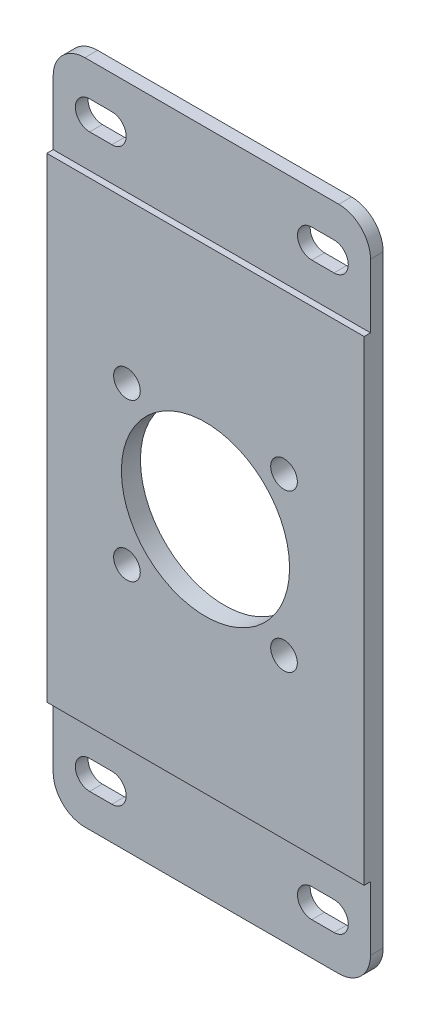
ISO-10303-21;
HEADER;
FILE_DESCRIPTION(('STEP AP214'),'2;1');
FILE_NAME('part.step','',(''),(''),'','','');
FILE_SCHEMA(('AUTOMOTIVE_DESIGN { 1 0 10303 214 1 1 1 1 }'));
ENDSEC;
DATA;
#1=APPLICATION_CONTEXT('core data for automotive mechanical design processes');
#2=APPLICATION_PROTOCOL_DEFINITION('international standard','automotive_design',2000,#1);
#3=PRODUCT_CONTEXT('',#1,'mechanical');
#4=PRODUCT('Part','Part','',(#3));
#5=PRODUCT_RELATED_PRODUCT_CATEGORY('part','',(#4));
#6=PRODUCT_DEFINITION_FORMATION('','',#4);
#7=PRODUCT_DEFINITION_CONTEXT('part definition',#1,'design');
#8=PRODUCT_DEFINITION('design','',#6,#7);
#9=PRODUCT_DEFINITION_SHAPE('','',#8);
#10=(LENGTH_UNIT() NAMED_UNIT(*) SI_UNIT(.MILLI.,.METRE.));
#11=(NAMED_UNIT(*) PLANE_ANGLE_UNIT() SI_UNIT($,.RADIAN.));
#12=(NAMED_UNIT(*) SI_UNIT($,.STERADIAN.) SOLID_ANGLE_UNIT());
#13=UNCERTAINTY_MEASURE_WITH_UNIT(LENGTH_MEASURE(1.E-05),#10,'distance_accuracy_value','');
#14=(GEOMETRIC_REPRESENTATION_CONTEXT(3) GLOBAL_UNCERTAINTY_ASSIGNED_CONTEXT((#13)) GLOBAL_UNIT_ASSIGNED_CONTEXT((#10,
#11,#12)) REPRESENTATION_CONTEXT('',''));
#15=CARTESIAN_POINT('',(0.,0.,0.));
#16=DIRECTION('',(0.,0.,1.));
#17=DIRECTION('',(1.,0.,0.));
#18=AXIS2_PLACEMENT_3D('',#15,#16,#17);
#19=CARTESIAN_POINT('',(0.,105.,3.));
#20=DIRECTION('',(0.,-1.,0.));
#21=DIRECTION('',(0.,0.,-1.));
#22=AXIS2_PLACEMENT_3D('',#19,#20,#21);
#23=PLANE('',#22);
#24=DIRECTION('',(-1.,0.,0.));
#25=VECTOR('',#24,1.);
#26=CARTESIAN_POINT('',(0.,105.,0.));
#27=LINE('',#26,#25);
#28=CARTESIAN_POINT('',(45.,105.,0.));
#29=VERTEX_POINT('',#28);
#30=CARTESIAN_POINT('',(5.,105.,0.));
#31=VERTEX_POINT('',#30);
#32=EDGE_CURVE('E424',#29,#31,#27,.T.);
#33=ORIENTED_EDGE('',*,*,#32,.T.);
#34=DIRECTION('',(0.,0.,-1.));
#35=VECTOR('',#34,1.);
#36=CARTESIAN_POINT('',(5.,105.,3.));
#37=LINE('',#36,#35);
#38=CARTESIAN_POINT('',(5.,105.,2.));
#39=VERTEX_POINT('',#38);
#40=EDGE_CURVE('E58',#31,#39,#37,.F.);
#41=ORIENTED_EDGE('',*,*,#40,.T.);
#42=DIRECTION('',(-1.,0.,0.));
#43=VECTOR('',#42,1.);
#44=CARTESIAN_POINT('',(0.,105.,2.));
#45=LINE('',#44,#43);
#46=CARTESIAN_POINT('',(45.,105.,2.));
#47=VERTEX_POINT('',#46);
#48=EDGE_CURVE('E253',#47,#39,#45,.T.);
#49=ORIENTED_EDGE('',*,*,#48,.F.);
#50=DIRECTION('',(0.,0.,-1.));
#51=VECTOR('',#50,1.);
#52=CARTESIAN_POINT('',(45.,105.,3.));
#53=LINE('',#52,#51);
#54=EDGE_CURVE('E466',#47,#29,#53,.T.);
#55=ORIENTED_EDGE('',*,*,#54,.T.);
#56=EDGE_LOOP('',(#33,#41,#49,#55));
#57=FACE_BOUND('',#56,.T.);
#58=ADVANCED_FACE('F43',(#57),#23,.F.);
#59=CARTESIAN_POINT('',(40.7500001007836,97.5,3.));
#60=DIRECTION('',(0.,0.,-1.));
#61=DIRECTION('',(-1.,0.,0.));
#62=AXIS2_PLACEMENT_3D('',#59,#60,#61);
#63=CYLINDRICAL_SURFACE('',#62,2.25);
#64=DIRECTION('',(0.,0.,-1.));
#65=VECTOR('',#64,1.);
#66=CARTESIAN_POINT('',(40.7500001007836,99.75,3.));
#67=LINE('',#66,#65);
#68=CARTESIAN_POINT('',(40.7500001007836,99.75,2.));
#69=VERTEX_POINT('',#68);
#70=CARTESIAN_POINT('',(40.7500001007836,99.75,0.));
#71=VERTEX_POINT('',#70);
#72=EDGE_CURVE('E343',#69,#71,#67,.T.);
#73=ORIENTED_EDGE('',*,*,#72,.F.);
#74=CARTESIAN_POINT('',(40.7500001007836,97.5,2.));
#75=DIRECTION('',(0.,0.,1.));
#76=DIRECTION('',(1.,0.,0.));
#77=AXIS2_PLACEMENT_3D('',#74,#75,#76);
#78=CIRCLE('',#77,2.25);
#79=CARTESIAN_POINT('',(40.7500001007836,95.25,2.));
#80=VERTEX_POINT('',#79);
#81=EDGE_CURVE('E294',#69,#80,#78,.T.);
#82=ORIENTED_EDGE('',*,*,#81,.T.);
#83=DIRECTION('',(0.,0.,-1.));
#84=VECTOR('',#83,1.);
#85=CARTESIAN_POINT('',(40.7500001007836,95.25,3.));
#86=LINE('',#85,#84);
#87=CARTESIAN_POINT('',(40.7500001007836,95.25,0.));
#88=VERTEX_POINT('',#87);
#89=EDGE_CURVE('E349',#80,#88,#86,.T.);
#90=ORIENTED_EDGE('',*,*,#89,.T.);
#91=CARTESIAN_POINT('',(40.7500001007836,97.5,0.));
#92=DIRECTION('',(0.,0.,1.));
#93=DIRECTION('',(1.,0.,0.));
#94=AXIS2_PLACEMENT_3D('',#91,#92,#93);
#95=CIRCLE('',#94,2.25);
#96=EDGE_CURVE('E331',#71,#88,#95,.T.);
#97=ORIENTED_EDGE('',*,*,#96,.F.);
#98=EDGE_LOOP('',(#73,#82,#90,#97));
#99=FACE_BOUND('',#98,.T.);
#100=ADVANCED_FACE('F515',(#99),#63,.F.);
#101=CARTESIAN_POINT('',(40.7500001007836,95.25,3.));
#102=DIRECTION('',(0.,1.,0.));
#103=DIRECTION('',(0.,0.,1.));
#104=AXIS2_PLACEMENT_3D('',#101,#102,#103);
#105=PLANE('',#104);
#106=ORIENTED_EDGE('',*,*,#89,.F.);
#107=DIRECTION('',(1.,0.,0.));
#108=VECTOR('',#107,1.);
#109=CARTESIAN_POINT('',(40.7500001007836,95.25,2.));
#110=LINE('',#109,#108);
#111=CARTESIAN_POINT('',(44.2500001007836,95.25,2.));
#112=VERTEX_POINT('',#111);
#113=EDGE_CURVE('E291',#80,#112,#110,.T.);
#114=ORIENTED_EDGE('',*,*,#113,.T.);
#115=DIRECTION('',(0.,0.,-1.));
#116=VECTOR('',#115,1.);
#117=CARTESIAN_POINT('',(44.2500001007836,95.25,3.));
#118=LINE('',#117,#116);
#119=CARTESIAN_POINT('',(44.2500001007836,95.25,0.));
#120=VERTEX_POINT('',#119);
#121=EDGE_CURVE('E347',#112,#120,#118,.T.);
#122=ORIENTED_EDGE('',*,*,#121,.T.);
#123=DIRECTION('',(1.,0.,0.));
#124=VECTOR('',#123,1.);
#125=CARTESIAN_POINT('',(40.7500001007836,95.25,0.));
#126=LINE('',#125,#124);
#127=EDGE_CURVE('E334',#88,#120,#126,.T.);
#128=ORIENTED_EDGE('',*,*,#127,.F.);
#129=EDGE_LOOP('',(#106,#114,#122,#128));
#130=FACE_BOUND('',#129,.T.);
#131=ADVANCED_FACE('F522',(#130),#105,.T.);
#132=CARTESIAN_POINT('',(44.2500001007836,97.5,3.));
#133=DIRECTION('',(0.,0.,-1.));
#134=DIRECTION('',(-1.,0.,0.));
#135=AXIS2_PLACEMENT_3D('',#132,#133,#134);
#136=CYLINDRICAL_SURFACE('',#135,2.25);
#137=ORIENTED_EDGE('',*,*,#121,.F.);
#138=CARTESIAN_POINT('',(44.2500001007836,97.5,2.));
#139=DIRECTION('',(0.,0.,1.));
#140=DIRECTION('',(1.,0.,0.));
#141=AXIS2_PLACEMENT_3D('',#138,#139,#140);
#142=CIRCLE('',#141,2.25);
#143=CARTESIAN_POINT('',(44.2500001007836,99.75,2.));
#144=VERTEX_POINT('',#143);
#145=EDGE_CURVE('E288',#112,#144,#142,.T.);
#146=ORIENTED_EDGE('',*,*,#145,.T.);
#147=DIRECTION('',(0.,0.,-1.));
#148=VECTOR('',#147,1.);
#149=CARTESIAN_POINT('',(44.2500001007836,99.75,3.));
#150=LINE('',#149,#148);
#151=CARTESIAN_POINT('',(44.2500001007836,99.75,0.));
#152=VERTEX_POINT('',#151);
#153=EDGE_CURVE('E345',#144,#152,#150,.T.);
#154=ORIENTED_EDGE('',*,*,#153,.T.);
#155=CARTESIAN_POINT('',(44.2500001007836,97.5,0.));
#156=DIRECTION('',(0.,0.,1.));
#157=DIRECTION('',(1.,0.,0.));
#158=AXIS2_PLACEMENT_3D('',#155,#156,#157);
#159=CIRCLE('',#158,2.25);
#160=EDGE_CURVE('E337',#120,#152,#159,.T.);
#161=ORIENTED_EDGE('',*,*,#160,.F.);
#162=EDGE_LOOP('',(#137,#146,#154,#161));
#163=FACE_BOUND('',#162,.T.);
#164=ADVANCED_FACE('F606',(#163),#136,.F.);
#165=CARTESIAN_POINT('',(40.7500001007836,99.75,3.));
#166=DIRECTION('',(0.,-1.,0.));
#167=DIRECTION('',(0.,0.,-1.));
#168=AXIS2_PLACEMENT_3D('',#165,#166,#167);
#169=PLANE('',#168);
#170=ORIENTED_EDGE('',*,*,#153,.F.);
#171=DIRECTION('',(-1.,0.,0.));
#172=VECTOR('',#171,1.);
#173=CARTESIAN_POINT('',(40.7500001007836,99.75,2.));
#174=LINE('',#173,#172);
#175=EDGE_CURVE('E285',#144,#69,#174,.T.);
#176=ORIENTED_EDGE('',*,*,#175,.T.);
#177=ORIENTED_EDGE('',*,*,#72,.T.);
#178=DIRECTION('',(-1.,0.,0.));
#179=VECTOR('',#178,1.);
#180=CARTESIAN_POINT('',(40.7500001007836,99.75,0.));
#181=LINE('',#180,#179);
#182=EDGE_CURVE('E340',#152,#71,#181,.T.);
#183=ORIENTED_EDGE('',*,*,#182,.F.);
#184=EDGE_LOOP('',(#170,#176,#177,#183));
#185=FACE_BOUND('',#184,.T.);
#186=ADVANCED_FACE('F616',(#185),#169,.T.);
#187=CARTESIAN_POINT('',(5.7499998992164,97.4999999999998,3.));
#188=DIRECTION('',(0.,0.,-1.));
#189=DIRECTION('',(-1.,0.,0.));
#190=AXIS2_PLACEMENT_3D('',#187,#188,#189);
#191=CYLINDRICAL_SURFACE('',#190,2.25000000000002);
#192=DIRECTION('',(0.,0.,-1.));
#193=VECTOR('',#192,1.);
#194=CARTESIAN_POINT('',(5.7499998992164,99.75,3.));
#195=LINE('',#194,#193);
#196=CARTESIAN_POINT('',(5.7499998992164,99.75,2.));
#197=VERTEX_POINT('',#196);
#198=CARTESIAN_POINT('',(5.7499998992164,99.75,0.));
#199=VERTEX_POINT('',#198);
#200=EDGE_CURVE('E323',#197,#199,#195,.T.);
#201=ORIENTED_EDGE('',*,*,#200,.F.);
#202=CARTESIAN_POINT('',(5.7499998992164,97.4999999999998,2.));
#203=DIRECTION('',(0.,0.,1.));
#204=DIRECTION('',(1.,0.,0.));
#205=AXIS2_PLACEMENT_3D('',#202,#203,#204);
#206=CIRCLE('',#205,2.25000000000002);
#207=CARTESIAN_POINT('',(5.7499998992164,95.25,2.));
#208=VERTEX_POINT('',#207);
#209=EDGE_CURVE('E282',#197,#208,#206,.T.);
#210=ORIENTED_EDGE('',*,*,#209,.T.);
#211=DIRECTION('',(0.,0.,-1.));
#212=VECTOR('',#211,1.);
#213=CARTESIAN_POINT('',(5.7499998992164,95.25,3.));
#214=LINE('',#213,#212);
#215=CARTESIAN_POINT('',(5.7499998992164,95.25,0.));
#216=VERTEX_POINT('',#215);
#217=EDGE_CURVE('E329',#208,#216,#214,.T.);
#218=ORIENTED_EDGE('',*,*,#217,.T.);
#219=CARTESIAN_POINT('',(5.7499998992164,97.4999999999998,0.));
#220=DIRECTION('',(0.,0.,1.));
#221=DIRECTION('',(1.,0.,0.));
#222=AXIS2_PLACEMENT_3D('',#219,#220,#221);
#223=CIRCLE('',#222,2.25000000000002);
#224=EDGE_CURVE('E311',#199,#216,#223,.T.);
#225=ORIENTED_EDGE('',*,*,#224,.F.);
#226=EDGE_LOOP('',(#201,#210,#218,#225));
#227=FACE_BOUND('',#226,.T.);
#228=ADVANCED_FACE('F626',(#227),#191,.F.);
#229=CARTESIAN_POINT('',(5.7499998992164,95.25,3.));
#230=DIRECTION('',(0.,1.,0.));
#231=DIRECTION('',(0.,0.,1.));
#232=AXIS2_PLACEMENT_3D('',#229,#230,#231);
#233=PLANE('',#232);
#234=ORIENTED_EDGE('',*,*,#217,.F.);
#235=DIRECTION('',(1.,0.,0.));
#236=VECTOR('',#235,1.);
#237=CARTESIAN_POINT('',(5.7499998992164,95.25,2.));
#238=LINE('',#237,#236);
#239=CARTESIAN_POINT('',(9.2499998992164,95.2499999999998,2.));
#240=VERTEX_POINT('',#239);
#241=EDGE_CURVE('E279',#208,#240,#238,.T.);
#242=ORIENTED_EDGE('',*,*,#241,.T.);
#243=DIRECTION('',(0.,0.,-1.));
#244=VECTOR('',#243,1.);
#245=CARTESIAN_POINT('',(9.2499998992164,95.2499999999998,3.));
#246=LINE('',#245,#244);
#247=CARTESIAN_POINT('',(9.2499998992164,95.2499999999998,0.));
#248=VERTEX_POINT('',#247);
#249=EDGE_CURVE('E327',#240,#248,#246,.T.);
#250=ORIENTED_EDGE('',*,*,#249,.T.);
#251=DIRECTION('',(1.,0.,0.));
#252=VECTOR('',#251,1.);
#253=CARTESIAN_POINT('',(5.7499998992164,95.25,0.));
#254=LINE('',#253,#252);
#255=EDGE_CURVE('E314',#216,#248,#254,.T.);
#256=ORIENTED_EDGE('',*,*,#255,.F.);
#257=EDGE_LOOP('',(#234,#242,#250,#256));
#258=FACE_BOUND('',#257,.T.);
#259=ADVANCED_FACE('F636',(#258),#233,.T.);
#260=CARTESIAN_POINT('',(9.2499998992164,97.4999999999998,3.));
#261=DIRECTION('',(0.,0.,-1.));
#262=DIRECTION('',(-1.,0.,0.));
#263=AXIS2_PLACEMENT_3D('',#260,#261,#262);
#264=CYLINDRICAL_SURFACE('',#263,2.25000000000002);
#265=ORIENTED_EDGE('',*,*,#249,.F.);
#266=CARTESIAN_POINT('',(9.2499998992164,97.4999999999998,2.));
#267=DIRECTION('',(0.,0.,1.));
#268=DIRECTION('',(1.,0.,0.));
#269=AXIS2_PLACEMENT_3D('',#266,#267,#268);
#270=CIRCLE('',#269,2.25000000000002);
#271=CARTESIAN_POINT('',(9.2499998992164,99.75,2.));
#272=VERTEX_POINT('',#271);
#273=EDGE_CURVE('E255',#240,#272,#270,.T.);
#274=ORIENTED_EDGE('',*,*,#273,.T.);
#275=DIRECTION('',(0.,0.,-1.));
#276=VECTOR('',#275,1.);
#277=CARTESIAN_POINT('',(9.2499998992164,99.75,3.));
#278=LINE('',#277,#276);
#279=CARTESIAN_POINT('',(9.2499998992164,99.75,0.));
#280=VERTEX_POINT('',#279);
#281=EDGE_CURVE('E325',#272,#280,#278,.T.);
#282=ORIENTED_EDGE('',*,*,#281,.T.);
#283=CARTESIAN_POINT('',(9.2499998992164,97.4999999999998,0.));
#284=DIRECTION('',(0.,0.,1.));
#285=DIRECTION('',(1.,0.,0.));
#286=AXIS2_PLACEMENT_3D('',#283,#284,#285);
#287=CIRCLE('',#286,2.25000000000002);
#288=EDGE_CURVE('E317',#248,#280,#287,.T.);
#289=ORIENTED_EDGE('',*,*,#288,.F.);
#290=EDGE_LOOP('',(#265,#274,#282,#289));
#291=FACE_BOUND('',#290,.T.);
#292=ADVANCED_FACE('F646',(#291),#264,.F.);
#293=CARTESIAN_POINT('',(5.7499998992164,99.75,3.));
#294=DIRECTION('',(0.,-1.,0.));
#295=DIRECTION('',(0.,0.,-1.));
#296=AXIS2_PLACEMENT_3D('',#293,#294,#295);
#297=PLANE('',#296);
#298=ORIENTED_EDGE('',*,*,#281,.F.);
#299=DIRECTION('',(-1.,0.,0.));
#300=VECTOR('',#299,1.);
#301=CARTESIAN_POINT('',(5.7499998992164,99.75,2.));
#302=LINE('',#301,#300);
#303=EDGE_CURVE('E427',#272,#197,#302,.T.);
#304=ORIENTED_EDGE('',*,*,#303,.T.);
#305=ORIENTED_EDGE('',*,*,#200,.T.);
#306=DIRECTION('',(-1.,0.,0.));
#307=VECTOR('',#306,1.);
#308=CARTESIAN_POINT('',(5.7499998992164,99.75,0.));
#309=LINE('',#308,#307);
#310=EDGE_CURVE('E320',#280,#199,#309,.T.);
#311=ORIENTED_EDGE('',*,*,#310,.F.);
#312=EDGE_LOOP('',(#298,#304,#305,#311));
#313=FACE_BOUND('',#312,.T.);
#314=ADVANCED_FACE('F656',(#313),#297,.T.);
#315=CARTESIAN_POINT('',(0.,0.,3.));
#316=DIRECTION('',(0.,0.,-1.));
#317=DIRECTION('',(-1.,0.,0.));
#318=AXIS2_PLACEMENT_3D('',#315,#316,#317);
#319=PLANE('',#318);
#320=DIRECTION('',(0.,1.,0.));
#321=VECTOR('',#320,1.);
#322=CARTESIAN_POINT('',(50.,0.,3.));
#323=LINE('',#322,#321);
#324=CARTESIAN_POINT('',(50.,15.05,3.));
#325=VERTEX_POINT('',#324);
#326=CARTESIAN_POINT('',(50.,89.95,3.));
#327=VERTEX_POINT('',#326);
#328=EDGE_CURVE('E423',#325,#327,#323,.T.);
#329=ORIENTED_EDGE('',*,*,#328,.T.);
#330=DIRECTION('',(1.,0.,0.));
#331=VECTOR('',#330,1.);
#332=CARTESIAN_POINT('',(0.,89.95,3.));
#333=LINE('',#332,#331);
#334=CARTESIAN_POINT('',(0.,89.95,3.));
#335=VERTEX_POINT('',#334);
#336=EDGE_CURVE('E237',#335,#327,#333,.T.);
#337=ORIENTED_EDGE('',*,*,#336,.F.);
#338=DIRECTION('',(0.,-1.,0.));
#339=VECTOR('',#338,1.);
#340=CARTESIAN_POINT('',(0.,0.,3.));
#341=LINE('',#340,#339);
#342=CARTESIAN_POINT('',(0.,15.05,3.));
#343=VERTEX_POINT('',#342);
#344=EDGE_CURVE('E252',#335,#343,#341,.T.);
#345=ORIENTED_EDGE('',*,*,#344,.T.);
#346=DIRECTION('',(-1.,0.,0.));
#347=VECTOR('',#346,1.);
#348=CARTESIAN_POINT('',(0.,15.05,3.));
#349=LINE('',#348,#347);
#350=EDGE_CURVE('E265',#325,#343,#349,.T.);
#351=ORIENTED_EDGE('',*,*,#350,.F.);
#352=EDGE_LOOP('',(#329,#337,#345,#351));
#353=FACE_BOUND('',#352,.T.);
#354=CARTESIAN_POINT('',(25.,52.5,3.));
#355=DIRECTION('',(0.,0.,1.));
#356=DIRECTION('',(1.,0.,0.));
#357=AXIS2_PLACEMENT_3D('',#354,#355,#356);
#358=CIRCLE('',#357,13.25);
#359=CARTESIAN_POINT('',(38.25,52.5,3.));
#360=VERTEX_POINT('',#359);
#361=EDGE_CURVE('E416',#360,#360,#358,.T.);
#362=ORIENTED_EDGE('',*,*,#361,.F.);
#363=EDGE_LOOP('',(#362));
#364=FACE_BOUND('',#363,.T.);
#365=CARTESIAN_POINT('',(37.3743686707645,64.8743686707647,3.));
#366=DIRECTION('',(0.,0.,1.));
#367=DIRECTION('',(1.,0.,0.));
#368=AXIS2_PLACEMENT_3D('',#365,#366,#367);
#369=CIRCLE('',#368,2.1);
#370=CARTESIAN_POINT('',(39.4743686707645,64.8743686707647,3.));
#371=VERTEX_POINT('',#370);
#372=EDGE_CURVE('E410',#371,#371,#369,.T.);
#373=ORIENTED_EDGE('',*,*,#372,.F.);
#374=EDGE_LOOP('',(#373));
#375=FACE_BOUND('',#374,.T.);
#376=CARTESIAN_POINT('',(12.6256313292353,64.8743686707645,3.));
#377=DIRECTION('',(0.,0.,1.));
#378=DIRECTION('',(1.,0.,0.));
#379=AXIS2_PLACEMENT_3D('',#376,#377,#378);
#380=CIRCLE('',#379,2.1);
#381=CARTESIAN_POINT('',(14.7256313292353,64.8743686707645,3.));
#382=VERTEX_POINT('',#381);
#383=EDGE_CURVE('E404',#382,#382,#380,.T.);
#384=ORIENTED_EDGE('',*,*,#383,.F.);
#385=EDGE_LOOP('',(#384));
#386=FACE_BOUND('',#385,.T.);
#387=CARTESIAN_POINT('',(37.3743686707646,40.1256313292355,3.));
#388=DIRECTION('',(0.,0.,1.));
#389=DIRECTION('',(1.,0.,0.));
#390=AXIS2_PLACEMENT_3D('',#387,#388,#389);
#391=CIRCLE('',#390,2.1);
#392=CARTESIAN_POINT('',(39.4743686707646,40.1256313292355,3.));
#393=VERTEX_POINT('',#392);
#394=EDGE_CURVE('E398',#393,#393,#391,.T.);
#395=ORIENTED_EDGE('',*,*,#394,.F.);
#396=EDGE_LOOP('',(#395));
#397=FACE_BOUND('',#396,.T.);
#398=CARTESIAN_POINT('',(12.6256313292355,40.1256313292354,3.));
#399=DIRECTION('',(0.,0.,1.));
#400=DIRECTION('',(1.,0.,0.));
#401=AXIS2_PLACEMENT_3D('',#398,#399,#400);
#402=CIRCLE('',#401,2.1);
#403=CARTESIAN_POINT('',(14.7256313292355,40.1256313292354,3.));
#404=VERTEX_POINT('',#403);
#405=EDGE_CURVE('E392',#404,#404,#402,.T.);
#406=ORIENTED_EDGE('',*,*,#405,.F.);
#407=EDGE_LOOP('',(#406));
#408=FACE_BOUND('',#407,.T.);
#409=ADVANCED_FACE('F506',(#353,#364,#375,#386,#397,#408),#319,.F.);
#410=CARTESIAN_POINT('',(0.,0.,0.));
#411=DIRECTION('',(0.,0.,-1.));
#412=DIRECTION('',(-1.,0.,0.));
#413=AXIS2_PLACEMENT_3D('',#410,#411,#412);
#414=PLANE('',#413);
#415=CARTESIAN_POINT('',(37.3743686707646,40.1256313292355,0.));
#416=DIRECTION('',(0.,0.,1.));
#417=DIRECTION('',(1.,0.,0.));
#418=AXIS2_PLACEMENT_3D('',#415,#416,#417);
#419=CIRCLE('',#418,2.1);
#420=CARTESIAN_POINT('',(39.4743686707646,40.1256313292355,0.));
#421=VERTEX_POINT('',#420);
#422=EDGE_CURVE('E395',#421,#421,#419,.T.);
#423=ORIENTED_EDGE('',*,*,#422,.T.);
#424=EDGE_LOOP('',(#423));
#425=FACE_BOUND('',#424,.T.);
#426=CARTESIAN_POINT('',(37.3743686707645,64.8743686707647,0.));
#427=DIRECTION('',(0.,0.,1.));
#428=DIRECTION('',(1.,0.,0.));
#429=AXIS2_PLACEMENT_3D('',#426,#427,#428);
#430=CIRCLE('',#429,2.1);
#431=CARTESIAN_POINT('',(39.4743686707645,64.8743686707647,0.));
#432=VERTEX_POINT('',#431);
#433=EDGE_CURVE('E407',#432,#432,#430,.T.);
#434=ORIENTED_EDGE('',*,*,#433,.T.);
#435=EDGE_LOOP('',(#434));
#436=FACE_BOUND('',#435,.T.);
#437=DIRECTION('',(1.,0.,0.));
#438=VECTOR('',#437,1.);
#439=CARTESIAN_POINT('',(0.,0.,0.));
#440=LINE('',#439,#438);
#441=CARTESIAN_POINT('',(5.,0.,0.));
#442=VERTEX_POINT('',#441);
#443=CARTESIAN_POINT('',(45.,0.,0.));
#444=VERTEX_POINT('',#443);
#445=EDGE_CURVE('E429',#442,#444,#440,.T.);
#446=ORIENTED_EDGE('',*,*,#445,.F.);
#447=CARTESIAN_POINT('',(5.,5.,0.));
#448=DIRECTION('',(0.,0.,-1.));
#449=DIRECTION('',(-1.,0.,0.));
#450=AXIS2_PLACEMENT_3D('',#447,#448,#449);
#451=CIRCLE('',#450,5.);
#452=CARTESIAN_POINT('',(0.,5.,0.));
#453=VERTEX_POINT('',#452);
#454=EDGE_CURVE('E451',#442,#453,#451,.T.);
#455=ORIENTED_EDGE('',*,*,#454,.T.);
#456=DIRECTION('',(0.,-1.,0.));
#457=VECTOR('',#456,1.);
#458=CARTESIAN_POINT('',(0.,0.,0.));
#459=LINE('',#458,#457);
#460=CARTESIAN_POINT('',(0.,100.,0.));
#461=VERTEX_POINT('',#460);
#462=EDGE_CURVE('E419',#461,#453,#459,.T.);
#463=ORIENTED_EDGE('',*,*,#462,.F.);
#464=CARTESIAN_POINT('',(5.,100.,0.));
#465=DIRECTION('',(0.,0.,-1.));
#466=DIRECTION('',(-1.,0.,0.));
#467=AXIS2_PLACEMENT_3D('',#464,#465,#466);
#468=CIRCLE('',#467,5.);
#469=EDGE_CURVE('E447',#461,#31,#468,.T.);
#470=ORIENTED_EDGE('',*,*,#469,.T.);
#471=ORIENTED_EDGE('',*,*,#32,.F.);
#472=CARTESIAN_POINT('',(45.,100.,0.));
#473=DIRECTION('',(0.,0.,-1.));
#474=DIRECTION('',(-1.,0.,0.));
#475=AXIS2_PLACEMENT_3D('',#472,#473,#474);
#476=CIRCLE('',#475,5.);
#477=CARTESIAN_POINT('',(50.,100.,0.));
#478=VERTEX_POINT('',#477);
#479=EDGE_CURVE('E445',#29,#478,#476,.T.);
#480=ORIENTED_EDGE('',*,*,#479,.T.);
#481=DIRECTION('',(0.,1.,0.));
#482=VECTOR('',#481,1.);
#483=CARTESIAN_POINT('',(50.,0.,0.));
#484=LINE('',#483,#482);
#485=CARTESIAN_POINT('',(50.,5.00000000000001,0.));
#486=VERTEX_POINT('',#485);
#487=EDGE_CURVE('E432',#486,#478,#484,.T.);
#488=ORIENTED_EDGE('',*,*,#487,.F.);
#489=CARTESIAN_POINT('',(45.,5.00000000000001,0.));
#490=DIRECTION('',(0.,0.,-1.));
#491=DIRECTION('',(-1.,0.,0.));
#492=AXIS2_PLACEMENT_3D('',#489,#490,#491);
#493=CIRCLE('',#492,5.);
#494=EDGE_CURVE('E449',#486,#444,#493,.T.);
#495=ORIENTED_EDGE('',*,*,#494,.T.);
#496=EDGE_LOOP('',(#446,#455,#463,#470,#471,#480,#488,#495));
#497=FACE_BOUND('',#496,.T.);
#498=CARTESIAN_POINT('',(25.,52.5,0.));
#499=DIRECTION('',(0.,0.,1.));
#500=DIRECTION('',(1.,0.,0.));
#501=AXIS2_PLACEMENT_3D('',#498,#499,#500);
#502=CIRCLE('',#501,13.25);
#503=CARTESIAN_POINT('',(38.25,52.5,0.));
#504=VERTEX_POINT('',#503);
#505=EDGE_CURVE('E413',#504,#504,#502,.T.);
#506=ORIENTED_EDGE('',*,*,#505,.T.);
#507=EDGE_LOOP('',(#506));
#508=FACE_BOUND('',#507,.T.);
#509=CARTESIAN_POINT('',(12.6256313292353,64.8743686707645,0.));
#510=DIRECTION('',(0.,0.,1.));
#511=DIRECTION('',(1.,0.,0.));
#512=AXIS2_PLACEMENT_3D('',#509,#510,#511);
#513=CIRCLE('',#512,2.1);
#514=CARTESIAN_POINT('',(14.7256313292353,64.8743686707645,0.));
#515=VERTEX_POINT('',#514);
#516=EDGE_CURVE('E401',#515,#515,#513,.T.);
#517=ORIENTED_EDGE('',*,*,#516,.T.);
#518=EDGE_LOOP('',(#517));
#519=FACE_BOUND('',#518,.T.);
#520=CARTESIAN_POINT('',(12.6256313292355,40.1256313292354,0.));
#521=DIRECTION('',(0.,0.,1.));
#522=DIRECTION('',(1.,0.,0.));
#523=AXIS2_PLACEMENT_3D('',#520,#521,#522);
#524=CIRCLE('',#523,2.1);
#525=CARTESIAN_POINT('',(14.7256313292355,40.1256313292354,0.));
#526=VERTEX_POINT('',#525);
#527=EDGE_CURVE('E391',#526,#526,#524,.T.);
#528=ORIENTED_EDGE('',*,*,#527,.T.);
#529=EDGE_LOOP('',(#528));
#530=FACE_BOUND('',#529,.T.);
#531=DIRECTION('',(-1.,0.,0.));
#532=VECTOR('',#531,1.);
#533=CARTESIAN_POINT('',(5.75000000000001,9.74999999999999,0.));
#534=LINE('',#533,#532);
#535=CARTESIAN_POINT('',(9.25000000000001,9.74999999999999,0.));
#536=VERTEX_POINT('',#535);
#537=CARTESIAN_POINT('',(5.75000000000001,9.74999999999999,0.));
#538=VERTEX_POINT('',#537);
#539=EDGE_CURVE('E380',#536,#538,#534,.T.);
#540=ORIENTED_EDGE('',*,*,#539,.T.);
#541=CARTESIAN_POINT('',(5.75000000000001,7.49999999999999,0.));
#542=DIRECTION('',(0.,0.,1.));
#543=DIRECTION('',(1.,0.,0.));
#544=AXIS2_PLACEMENT_3D('',#541,#542,#543);
#545=CIRCLE('',#544,2.25);
#546=CARTESIAN_POINT('',(5.75000000000001,5.24999999999999,0.));
#547=VERTEX_POINT('',#546);
#548=EDGE_CURVE('E371',#538,#547,#545,.T.);
#549=ORIENTED_EDGE('',*,*,#548,.T.);
#550=DIRECTION('',(1.,0.,0.));
#551=VECTOR('',#550,1.);
#552=CARTESIAN_POINT('',(5.75000000000001,5.24999999999999,0.));
#553=LINE('',#552,#551);
#554=CARTESIAN_POINT('',(9.25000000000001,5.24999999999999,0.));
#555=VERTEX_POINT('',#554);
#556=EDGE_CURVE('E374',#547,#555,#553,.T.);
#557=ORIENTED_EDGE('',*,*,#556,.T.);
#558=CARTESIAN_POINT('',(9.25000000000001,7.49999999999999,0.));
#559=DIRECTION('',(0.,0.,1.));
#560=DIRECTION('',(1.,0.,0.));
#561=AXIS2_PLACEMENT_3D('',#558,#559,#560);
#562=CIRCLE('',#561,2.25);
#563=EDGE_CURVE('E377',#555,#536,#562,.T.);
#564=ORIENTED_EDGE('',*,*,#563,.T.);
#565=EDGE_LOOP('',(#540,#549,#557,#564));
#566=FACE_BOUND('',#565,.T.);
#567=DIRECTION('',(-1.,0.,0.));
#568=VECTOR('',#567,1.);
#569=CARTESIAN_POINT('',(40.7500002015672,9.75,0.));
#570=LINE('',#569,#568);
#571=CARTESIAN_POINT('',(44.2500002015672,9.75,0.));
#572=VERTEX_POINT('',#571);
#573=CARTESIAN_POINT('',(40.7500002015672,9.75,0.));
#574=VERTEX_POINT('',#573);
#575=EDGE_CURVE('E360',#572,#574,#570,.T.);
#576=ORIENTED_EDGE('',*,*,#575,.T.);
#577=CARTESIAN_POINT('',(40.7500002015672,7.5,0.));
#578=DIRECTION('',(0.,0.,1.));
#579=DIRECTION('',(1.,0.,0.));
#580=AXIS2_PLACEMENT_3D('',#577,#578,#579);
#581=CIRCLE('',#580,2.25);
#582=CARTESIAN_POINT('',(40.7500002015672,5.25,0.));
#583=VERTEX_POINT('',#582);
#584=EDGE_CURVE('E351',#574,#583,#581,.T.);
#585=ORIENTED_EDGE('',*,*,#584,.T.);
#586=DIRECTION('',(1.,0.,0.));
#587=VECTOR('',#586,1.);
#588=CARTESIAN_POINT('',(40.7500002015672,5.25,0.));
#589=LINE('',#588,#587);
#590=CARTESIAN_POINT('',(44.2500002015672,5.25,0.));
#591=VERTEX_POINT('',#590);
#592=EDGE_CURVE('E354',#583,#591,#589,.T.);
#593=ORIENTED_EDGE('',*,*,#592,.T.);
#594=CARTESIAN_POINT('',(44.2500002015672,7.5,0.));
#595=DIRECTION('',(0.,0.,1.));
#596=DIRECTION('',(1.,0.,0.));
#597=AXIS2_PLACEMENT_3D('',#594,#595,#596);
#598=CIRCLE('',#597,2.25);
#599=EDGE_CURVE('E357',#591,#572,#598,.T.);
#600=ORIENTED_EDGE('',*,*,#599,.T.);
#601=EDGE_LOOP('',(#576,#585,#593,#600));
#602=FACE_BOUND('',#601,.T.);
#603=ORIENTED_EDGE('',*,*,#182,.T.);
#604=ORIENTED_EDGE('',*,*,#96,.T.);
#605=ORIENTED_EDGE('',*,*,#127,.T.);
#606=ORIENTED_EDGE('',*,*,#160,.T.);
#607=EDGE_LOOP('',(#603,#604,#605,#606));
#608=FACE_BOUND('',#607,.T.);
#609=ORIENTED_EDGE('',*,*,#310,.T.);
#610=ORIENTED_EDGE('',*,*,#224,.T.);
#611=ORIENTED_EDGE('',*,*,#255,.T.);
#612=ORIENTED_EDGE('',*,*,#288,.T.);
#613=EDGE_LOOP('',(#609,#610,#611,#612));
#614=FACE_BOUND('',#613,.T.);
#615=ADVANCED_FACE('F474',(#425,#436,#497,#508,#519,#530,#566,#602,#608,#614),#414,.T.);
#616=CARTESIAN_POINT('',(0.,0.,3.));
#617=DIRECTION('',(1.,0.,0.));
#618=DIRECTION('',(0.,0.,-1.));
#619=AXIS2_PLACEMENT_3D('',#616,#617,#618);
#620=PLANE('',#619);
#621=ORIENTED_EDGE('',*,*,#462,.T.);
#622=DIRECTION('',(0.,0.,-1.));
#623=VECTOR('',#622,1.);
#624=CARTESIAN_POINT('',(0.,5.,3.));
#625=LINE('',#624,#623);
#626=CARTESIAN_POINT('',(0.,5.,2.));
#627=VERTEX_POINT('',#626);
#628=EDGE_CURVE('E455',#453,#627,#625,.F.);
#629=ORIENTED_EDGE('',*,*,#628,.T.);
#630=DIRECTION('',(0.,-1.,0.));
#631=VECTOR('',#630,1.);
#632=CARTESIAN_POINT('',(0.,0.,2.));
#633=LINE('',#632,#631);
#634=CARTESIAN_POINT('',(0.,15.05,2.));
#635=VERTEX_POINT('',#634);
#636=EDGE_CURVE('E267',#635,#627,#633,.T.);
#637=ORIENTED_EDGE('',*,*,#636,.F.);
#638=DIRECTION('',(0.,0.,1.));
#639=VECTOR('',#638,1.);
#640=CARTESIAN_POINT('',(0.,15.05,2.));
#641=LINE('',#640,#639);
#642=EDGE_CURVE('E263',#635,#343,#641,.T.);
#643=ORIENTED_EDGE('',*,*,#642,.T.);
#644=ORIENTED_EDGE('',*,*,#344,.F.);
#645=DIRECTION('',(0.,0.,1.));
#646=VECTOR('',#645,1.);
#647=CARTESIAN_POINT('',(0.,89.95,2.));
#648=LINE('',#647,#646);
#649=CARTESIAN_POINT('',(0.,89.95,2.));
#650=VERTEX_POINT('',#649);
#651=EDGE_CURVE('E241',#650,#335,#648,.T.);
#652=ORIENTED_EDGE('',*,*,#651,.F.);
#653=DIRECTION('',(0.,-1.,0.));
#654=VECTOR('',#653,1.);
#655=CARTESIAN_POINT('',(0.,105.,2.));
#656=LINE('',#655,#654);
#657=CARTESIAN_POINT('',(0.,100.,2.));
#658=VERTEX_POINT('',#657);
#659=EDGE_CURVE('E227',#658,#650,#656,.T.);
#660=ORIENTED_EDGE('',*,*,#659,.F.);
#661=DIRECTION('',(0.,0.,-1.));
#662=VECTOR('',#661,1.);
#663=CARTESIAN_POINT('',(0.,100.,3.));
#664=LINE('',#663,#662);
#665=EDGE_CURVE('E453',#658,#461,#664,.T.);
#666=ORIENTED_EDGE('',*,*,#665,.T.);
#667=EDGE_LOOP('',(#621,#629,#637,#643,#644,#652,#660,#666));
#668=FACE_BOUND('',#667,.T.);
#669=ADVANCED_FACE('F249',(#668),#620,.F.);
#670=CARTESIAN_POINT('',(0.,0.,3.));
#671=DIRECTION('',(0.,1.,0.));
#672=DIRECTION('',(-1.,0.,0.));
#673=AXIS2_PLACEMENT_3D('',#670,#671,#672);
#674=PLANE('',#673);
#675=DIRECTION('',(1.,0.,0.));
#676=VECTOR('',#675,1.);
#677=CARTESIAN_POINT('',(0.,0.,2.));
#678=LINE('',#677,#676);
#679=CARTESIAN_POINT('',(5.,0.,2.));
#680=VERTEX_POINT('',#679);
#681=CARTESIAN_POINT('',(45.,0.,2.));
#682=VERTEX_POINT('',#681);
#683=EDGE_CURVE('E272',#680,#682,#678,.T.);
#684=ORIENTED_EDGE('',*,*,#683,.F.);
#685=DIRECTION('',(0.,0.,-1.));
#686=VECTOR('',#685,1.);
#687=CARTESIAN_POINT('',(5.,0.,3.));
#688=LINE('',#687,#686);
#689=EDGE_CURVE('E442',#680,#442,#688,.T.);
#690=ORIENTED_EDGE('',*,*,#689,.T.);
#691=ORIENTED_EDGE('',*,*,#445,.T.);
#692=DIRECTION('',(0.,0.,-1.));
#693=VECTOR('',#692,1.);
#694=CARTESIAN_POINT('',(45.,0.,3.));
#695=LINE('',#694,#693);
#696=EDGE_CURVE('E440',#444,#682,#695,.F.);
#697=ORIENTED_EDGE('',*,*,#696,.T.);
#698=EDGE_LOOP('',(#684,#690,#691,#697));
#699=FACE_BOUND('',#698,.T.);
#700=ADVANCED_FACE('F491',(#699),#674,.F.);
#701=CARTESIAN_POINT('',(50.,0.,3.));
#702=DIRECTION('',(-1.,0.,0.));
#703=DIRECTION('',(0.,0.,1.));
#704=AXIS2_PLACEMENT_3D('',#701,#702,#703);
#705=PLANE('',#704);
#706=DIRECTION('',(0.,1.,0.));
#707=VECTOR('',#706,1.);
#708=CARTESIAN_POINT('',(50.,0.,2.));
#709=LINE('',#708,#707);
#710=CARTESIAN_POINT('',(50.,5.00000000000001,2.));
#711=VERTEX_POINT('',#710);
#712=CARTESIAN_POINT('',(50.,15.05,2.));
#713=VERTEX_POINT('',#712);
#714=EDGE_CURVE('E270',#711,#713,#709,.T.);
#715=ORIENTED_EDGE('',*,*,#714,.F.);
#716=DIRECTION('',(0.,0.,-1.));
#717=VECTOR('',#716,1.);
#718=CARTESIAN_POINT('',(50.,5.00000000000001,3.));
#719=LINE('',#718,#717);
#720=EDGE_CURVE('E463',#711,#486,#719,.T.);
#721=ORIENTED_EDGE('',*,*,#720,.T.);
#722=ORIENTED_EDGE('',*,*,#487,.T.);
#723=DIRECTION('',(0.,0.,-1.));
#724=VECTOR('',#723,1.);
#725=CARTESIAN_POINT('',(50.,100.,3.));
#726=LINE('',#725,#724);
#727=CARTESIAN_POINT('',(50.,100.,2.));
#728=VERTEX_POINT('',#727);
#729=EDGE_CURVE('E461',#478,#728,#726,.F.);
#730=ORIENTED_EDGE('',*,*,#729,.T.);
#731=DIRECTION('',(0.,1.,0.));
#732=VECTOR('',#731,1.);
#733=CARTESIAN_POINT('',(50.,105.,2.));
#734=LINE('',#733,#732);
#735=CARTESIAN_POINT('',(50.,89.95,2.));
#736=VERTEX_POINT('',#735);
#737=EDGE_CURVE('E245',#736,#728,#734,.T.);
#738=ORIENTED_EDGE('',*,*,#737,.F.);
#739=DIRECTION('',(0.,0.,1.));
#740=VECTOR('',#739,1.);
#741=CARTESIAN_POINT('',(50.,89.95,2.));
#742=LINE('',#741,#740);
#743=EDGE_CURVE('E244',#736,#327,#742,.T.);
#744=ORIENTED_EDGE('',*,*,#743,.T.);
#745=ORIENTED_EDGE('',*,*,#328,.F.);
#746=DIRECTION('',(0.,0.,1.));
#747=VECTOR('',#746,1.);
#748=CARTESIAN_POINT('',(50.,15.05,2.));
#749=LINE('',#748,#747);
#750=EDGE_CURVE('E260',#713,#325,#749,.T.);
#751=ORIENTED_EDGE('',*,*,#750,.F.);
#752=EDGE_LOOP('',(#715,#721,#722,#730,#738,#744,#745,#751));
#753=FACE_BOUND('',#752,.T.);
#754=ADVANCED_FACE('F500',(#753),#705,.F.);
#755=CARTESIAN_POINT('',(25.,52.5,3.));
#756=DIRECTION('',(0.,0.,-1.));
#757=DIRECTION('',(-1.,0.,0.));
#758=AXIS2_PLACEMENT_3D('',#755,#756,#757);
#759=CYLINDRICAL_SURFACE('',#758,13.25);
#760=ORIENTED_EDGE('',*,*,#361,.T.);
#761=EDGE_LOOP('',(#760));
#762=FACE_BOUND('',#761,.T.);
#763=ORIENTED_EDGE('',*,*,#505,.F.);
#764=EDGE_LOOP('',(#763));
#765=FACE_BOUND('',#764,.T.);
#766=ADVANCED_FACE('F530',(#762,#765),#759,.F.);
#767=CARTESIAN_POINT('',(37.3743686707645,64.8743686707647,3.));
#768=DIRECTION('',(0.,0.,-1.));
#769=DIRECTION('',(-1.,0.,0.));
#770=AXIS2_PLACEMENT_3D('',#767,#768,#769);
#771=CYLINDRICAL_SURFACE('',#770,2.1);
#772=ORIENTED_EDGE('',*,*,#372,.T.);
#773=EDGE_LOOP('',(#772));
#774=FACE_BOUND('',#773,.T.);
#775=ORIENTED_EDGE('',*,*,#433,.F.);
#776=EDGE_LOOP('',(#775));
#777=FACE_BOUND('',#776,.T.);
#778=ADVANCED_FACE('F765',(#774,#777),#771,.F.);
#779=CARTESIAN_POINT('',(12.6256313292353,64.8743686707645,3.));
#780=DIRECTION('',(0.,0.,-1.));
#781=DIRECTION('',(-1.,0.,0.));
#782=AXIS2_PLACEMENT_3D('',#779,#780,#781);
#783=CYLINDRICAL_SURFACE('',#782,2.1);
#784=ORIENTED_EDGE('',*,*,#383,.T.);
#785=EDGE_LOOP('',(#784));
#786=FACE_BOUND('',#785,.T.);
#787=ORIENTED_EDGE('',*,*,#516,.F.);
#788=EDGE_LOOP('',(#787));
#789=FACE_BOUND('',#788,.T.);
#790=ADVANCED_FACE('F756',(#786,#789),#783,.F.);
#791=CARTESIAN_POINT('',(37.3743686707646,40.1256313292355,3.));
#792=DIRECTION('',(0.,0.,-1.));
#793=DIRECTION('',(-1.,0.,0.));
#794=AXIS2_PLACEMENT_3D('',#791,#792,#793);
#795=CYLINDRICAL_SURFACE('',#794,2.1);
#796=ORIENTED_EDGE('',*,*,#394,.T.);
#797=EDGE_LOOP('',(#796));
#798=FACE_BOUND('',#797,.T.);
#799=ORIENTED_EDGE('',*,*,#422,.F.);
#800=EDGE_LOOP('',(#799));
#801=FACE_BOUND('',#800,.T.);
#802=ADVANCED_FACE('F747',(#798,#801),#795,.F.);
#803=CARTESIAN_POINT('',(12.6256313292355,40.1256313292354,3.));
#804=DIRECTION('',(0.,0.,-1.));
#805=DIRECTION('',(-1.,0.,0.));
#806=AXIS2_PLACEMENT_3D('',#803,#804,#805);
#807=CYLINDRICAL_SURFACE('',#806,2.1);
#808=ORIENTED_EDGE('',*,*,#405,.T.);
#809=EDGE_LOOP('',(#808));
#810=FACE_BOUND('',#809,.T.);
#811=ORIENTED_EDGE('',*,*,#527,.F.);
#812=EDGE_LOOP('',(#811));
#813=FACE_BOUND('',#812,.T.);
#814=ADVANCED_FACE('F739',(#810,#813),#807,.F.);
#815=CARTESIAN_POINT('',(5.75000000000001,7.49999999999999,3.));
#816=DIRECTION('',(0.,0.,-1.));
#817=DIRECTION('',(-1.,0.,0.));
#818=AXIS2_PLACEMENT_3D('',#815,#816,#817);
#819=CYLINDRICAL_SURFACE('',#818,2.25);
#820=CARTESIAN_POINT('',(5.75000000000001,7.49999999999999,2.));
#821=DIRECTION('',(0.,0.,-1.));
#822=DIRECTION('',(-1.,0.,0.));
#823=AXIS2_PLACEMENT_3D('',#820,#821,#822);
#824=CIRCLE('',#823,2.25);
#825=CARTESIAN_POINT('',(5.75000000000001,5.24999999999999,2.));
#826=VERTEX_POINT('',#825);
#827=CARTESIAN_POINT('',(5.75000000000001,9.74999999999999,2.));
#828=VERTEX_POINT('',#827);
#829=EDGE_CURVE('E309',#826,#828,#824,.T.);
#830=ORIENTED_EDGE('',*,*,#829,.F.);
#831=DIRECTION('',(0.,0.,-1.));
#832=VECTOR('',#831,1.);
#833=CARTESIAN_POINT('',(5.75000000000001,5.24999999999999,3.));
#834=LINE('',#833,#832);
#835=EDGE_CURVE('E389',#826,#547,#834,.T.);
#836=ORIENTED_EDGE('',*,*,#835,.T.);
#837=ORIENTED_EDGE('',*,*,#548,.F.);
#838=DIRECTION('',(0.,0.,-1.));
#839=VECTOR('',#838,1.);
#840=CARTESIAN_POINT('',(5.75000000000001,9.74999999999999,3.));
#841=LINE('',#840,#839);
#842=EDGE_CURVE('E383',#828,#538,#841,.T.);
#843=ORIENTED_EDGE('',*,*,#842,.F.);
#844=EDGE_LOOP('',(#830,#836,#837,#843));
#845=FACE_BOUND('',#844,.T.);
#846=ADVANCED_FACE('F730',(#845),#819,.F.);
#847=CARTESIAN_POINT('',(5.75000000000001,5.24999999999999,3.));
#848=DIRECTION('',(0.,1.,0.));
#849=DIRECTION('',(0.,0.,1.));
#850=AXIS2_PLACEMENT_3D('',#847,#848,#849);
#851=PLANE('',#850);
#852=DIRECTION('',(-1.,0.,0.));
#853=VECTOR('',#852,1.);
#854=CARTESIAN_POINT('',(5.75000000000001,5.24999999999999,2.));
#855=LINE('',#854,#853);
#856=CARTESIAN_POINT('',(9.25000000000001,5.24999999999999,2.));
#857=VERTEX_POINT('',#856);
#858=EDGE_CURVE('E307',#857,#826,#855,.T.);
#859=ORIENTED_EDGE('',*,*,#858,.F.);
#860=DIRECTION('',(0.,0.,-1.));
#861=VECTOR('',#860,1.);
#862=CARTESIAN_POINT('',(9.25000000000001,5.24999999999999,3.));
#863=LINE('',#862,#861);
#864=EDGE_CURVE('E387',#857,#555,#863,.T.);
#865=ORIENTED_EDGE('',*,*,#864,.T.);
#866=ORIENTED_EDGE('',*,*,#556,.F.);
#867=ORIENTED_EDGE('',*,*,#835,.F.);
#868=EDGE_LOOP('',(#859,#865,#866,#867));
#869=FACE_BOUND('',#868,.T.);
#870=ADVANCED_FACE('F721',(#869),#851,.T.);
#871=CARTESIAN_POINT('',(9.25000000000001,7.49999999999999,3.));
#872=DIRECTION('',(0.,0.,-1.));
#873=DIRECTION('',(-1.,0.,0.));
#874=AXIS2_PLACEMENT_3D('',#871,#872,#873);
#875=CYLINDRICAL_SURFACE('',#874,2.25);
#876=CARTESIAN_POINT('',(9.25000000000001,7.49999999999999,2.));
#877=DIRECTION('',(0.,0.,-1.));
#878=DIRECTION('',(-1.,0.,0.));
#879=AXIS2_PLACEMENT_3D('',#876,#877,#878);
#880=CIRCLE('',#879,2.25);
#881=CARTESIAN_POINT('',(9.25000000000001,9.74999999999999,2.));
#882=VERTEX_POINT('',#881);
#883=EDGE_CURVE('E305',#882,#857,#880,.T.);
#884=ORIENTED_EDGE('',*,*,#883,.F.);
#885=DIRECTION('',(0.,0.,-1.));
#886=VECTOR('',#885,1.);
#887=CARTESIAN_POINT('',(9.25000000000001,9.74999999999999,3.));
#888=LINE('',#887,#886);
#889=EDGE_CURVE('E385',#882,#536,#888,.T.);
#890=ORIENTED_EDGE('',*,*,#889,.T.);
#891=ORIENTED_EDGE('',*,*,#563,.F.);
#892=ORIENTED_EDGE('',*,*,#864,.F.);
#893=EDGE_LOOP('',(#884,#890,#891,#892));
#894=FACE_BOUND('',#893,.T.);
#895=ADVANCED_FACE('F712',(#894),#875,.F.);
#896=CARTESIAN_POINT('',(5.75000000000001,9.74999999999999,3.));
#897=DIRECTION('',(0.,-1.,0.));
#898=DIRECTION('',(0.,0.,-1.));
#899=AXIS2_PLACEMENT_3D('',#896,#897,#898);
#900=PLANE('',#899);
#901=DIRECTION('',(1.,0.,0.));
#902=VECTOR('',#901,1.);
#903=CARTESIAN_POINT('',(5.75000000000001,9.74999999999999,2.));
#904=LINE('',#903,#902);
#905=EDGE_CURVE('E303',#828,#882,#904,.T.);
#906=ORIENTED_EDGE('',*,*,#905,.F.);
#907=ORIENTED_EDGE('',*,*,#842,.T.);
#908=ORIENTED_EDGE('',*,*,#539,.F.);
#909=ORIENTED_EDGE('',*,*,#889,.F.);
#910=EDGE_LOOP('',(#906,#907,#908,#909));
#911=FACE_BOUND('',#910,.T.);
#912=ADVANCED_FACE('F703',(#911),#900,.T.);
#913=CARTESIAN_POINT('',(40.7500002015672,7.5,3.));
#914=DIRECTION('',(0.,0.,-1.));
#915=DIRECTION('',(-1.,0.,0.));
#916=AXIS2_PLACEMENT_3D('',#913,#914,#915);
#917=CYLINDRICAL_SURFACE('',#916,2.25);
#918=CARTESIAN_POINT('',(40.7500002015672,7.5,2.));
#919=DIRECTION('',(0.,0.,-1.));
#920=DIRECTION('',(-1.,0.,0.));
#921=AXIS2_PLACEMENT_3D('',#918,#919,#920);
#922=CIRCLE('',#921,2.25);
#923=CARTESIAN_POINT('',(40.7500002015672,5.25,2.));
#924=VERTEX_POINT('',#923);
#925=CARTESIAN_POINT('',(40.7500002015672,9.75,2.));
#926=VERTEX_POINT('',#925);
#927=EDGE_CURVE('E301',#924,#926,#922,.T.);
#928=ORIENTED_EDGE('',*,*,#927,.F.);
#929=DIRECTION('',(0.,0.,-1.));
#930=VECTOR('',#929,1.);
#931=CARTESIAN_POINT('',(40.7500002015672,5.25,3.));
#932=LINE('',#931,#930);
#933=EDGE_CURVE('E369',#924,#583,#932,.T.);
#934=ORIENTED_EDGE('',*,*,#933,.T.);
#935=ORIENTED_EDGE('',*,*,#584,.F.);
#936=DIRECTION('',(0.,0.,-1.));
#937=VECTOR('',#936,1.);
#938=CARTESIAN_POINT('',(40.7500002015672,9.75,3.));
#939=LINE('',#938,#937);
#940=EDGE_CURVE('E363',#926,#574,#939,.T.);
#941=ORIENTED_EDGE('',*,*,#940,.F.);
#942=EDGE_LOOP('',(#928,#934,#935,#941));
#943=FACE_BOUND('',#942,.T.);
#944=ADVANCED_FACE('F694',(#943),#917,.F.);
#945=CARTESIAN_POINT('',(40.7500002015672,5.25,3.));
#946=DIRECTION('',(0.,1.,0.));
#947=DIRECTION('',(0.,0.,1.));
#948=AXIS2_PLACEMENT_3D('',#945,#946,#947);
#949=PLANE('',#948);
#950=DIRECTION('',(-1.,0.,0.));
#951=VECTOR('',#950,1.);
#952=CARTESIAN_POINT('',(40.7500002015672,5.25,2.));
#953=LINE('',#952,#951);
#954=CARTESIAN_POINT('',(44.2500002015672,5.25,2.));
#955=VERTEX_POINT('',#954);
#956=EDGE_CURVE('E299',#955,#924,#953,.T.);
#957=ORIENTED_EDGE('',*,*,#956,.F.);
#958=DIRECTION('',(0.,0.,-1.));
#959=VECTOR('',#958,1.);
#960=CARTESIAN_POINT('',(44.2500002015672,5.25,3.));
#961=LINE('',#960,#959);
#962=EDGE_CURVE('E367',#955,#591,#961,.T.);
#963=ORIENTED_EDGE('',*,*,#962,.T.);
#964=ORIENTED_EDGE('',*,*,#592,.F.);
#965=ORIENTED_EDGE('',*,*,#933,.F.);
#966=EDGE_LOOP('',(#957,#963,#964,#965));
#967=FACE_BOUND('',#966,.T.);
#968=ADVANCED_FACE('F685',(#967),#949,.T.);
#969=CARTESIAN_POINT('',(44.2500002015672,7.5,3.));
#970=DIRECTION('',(0.,0.,-1.));
#971=DIRECTION('',(-1.,0.,0.));
#972=AXIS2_PLACEMENT_3D('',#969,#970,#971);
#973=CYLINDRICAL_SURFACE('',#972,2.25);
#974=CARTESIAN_POINT('',(44.2500002015672,7.5,2.));
#975=DIRECTION('',(0.,0.,-1.));
#976=DIRECTION('',(-1.,0.,0.));
#977=AXIS2_PLACEMENT_3D('',#974,#975,#976);
#978=CIRCLE('',#977,2.25);
#979=CARTESIAN_POINT('',(44.2500002015672,9.75,2.));
#980=VERTEX_POINT('',#979);
#981=EDGE_CURVE('E297',#980,#955,#978,.T.);
#982=ORIENTED_EDGE('',*,*,#981,.F.);
#983=DIRECTION('',(0.,0.,-1.));
#984=VECTOR('',#983,1.);
#985=CARTESIAN_POINT('',(44.2500002015672,9.75,3.));
#986=LINE('',#985,#984);
#987=EDGE_CURVE('E365',#980,#572,#986,.T.);
#988=ORIENTED_EDGE('',*,*,#987,.T.);
#989=ORIENTED_EDGE('',*,*,#599,.F.);
#990=ORIENTED_EDGE('',*,*,#962,.F.);
#991=EDGE_LOOP('',(#982,#988,#989,#990));
#992=FACE_BOUND('',#991,.T.);
#993=ADVANCED_FACE('F676',(#992),#973,.F.);
#994=CARTESIAN_POINT('',(40.7500002015672,9.75,3.));
#995=DIRECTION('',(0.,-1.,0.));
#996=DIRECTION('',(0.,0.,-1.));
#997=AXIS2_PLACEMENT_3D('',#994,#995,#996);
#998=PLANE('',#997);
#999=DIRECTION('',(1.,0.,0.));
#1000=VECTOR('',#999,1.);
#1001=CARTESIAN_POINT('',(40.7500002015672,9.75,2.));
#1002=LINE('',#1001,#1000);
#1003=EDGE_CURVE('E438',#926,#980,#1002,.T.);
#1004=ORIENTED_EDGE('',*,*,#1003,.F.);
#1005=ORIENTED_EDGE('',*,*,#940,.T.);
#1006=ORIENTED_EDGE('',*,*,#575,.F.);
#1007=ORIENTED_EDGE('',*,*,#987,.F.);
#1008=EDGE_LOOP('',(#1004,#1005,#1006,#1007));
#1009=FACE_BOUND('',#1008,.T.);
#1010=ADVANCED_FACE('F586',(#1009),#998,.T.);
#1011=CARTESIAN_POINT('',(0.,89.95,2.));
#1012=DIRECTION('',(0.,-1.,0.));
#1013=DIRECTION('',(0.,0.,-1.));
#1014=AXIS2_PLACEMENT_3D('',#1011,#1012,#1013);
#1015=PLANE('',#1014);
#1016=ORIENTED_EDGE('',*,*,#336,.T.);
#1017=ORIENTED_EDGE('',*,*,#743,.F.);
#1018=DIRECTION('',(1.,0.,0.));
#1019=VECTOR('',#1018,1.);
#1020=CARTESIAN_POINT('',(0.,89.95,2.));
#1021=LINE('',#1020,#1019);
#1022=EDGE_CURVE('E230',#650,#736,#1021,.T.);
#1023=ORIENTED_EDGE('',*,*,#1022,.F.);
#1024=ORIENTED_EDGE('',*,*,#651,.T.);
#1025=EDGE_LOOP('',(#1016,#1017,#1023,#1024));
#1026=FACE_BOUND('',#1025,.T.);
#1027=ADVANCED_FACE('F240',(#1026),#1015,.F.);
#1028=CARTESIAN_POINT('',(0.,0.,2.));
#1029=DIRECTION('',(0.,0.,1.));
#1030=DIRECTION('',(1.,0.,0.));
#1031=AXIS2_PLACEMENT_3D('',#1028,#1029,#1030);
#1032=PLANE('',#1031);
#1033=ORIENTED_EDGE('',*,*,#175,.F.);
#1034=ORIENTED_EDGE('',*,*,#145,.F.);
#1035=ORIENTED_EDGE('',*,*,#113,.F.);
#1036=ORIENTED_EDGE('',*,*,#81,.F.);
#1037=EDGE_LOOP('',(#1033,#1034,#1035,#1036));
#1038=FACE_BOUND('',#1037,.T.);
#1039=ORIENTED_EDGE('',*,*,#303,.F.);
#1040=ORIENTED_EDGE('',*,*,#273,.F.);
#1041=ORIENTED_EDGE('',*,*,#241,.F.);
#1042=ORIENTED_EDGE('',*,*,#209,.F.);
#1043=EDGE_LOOP('',(#1039,#1040,#1041,#1042));
#1044=FACE_BOUND('',#1043,.T.);
#1045=ORIENTED_EDGE('',*,*,#48,.T.);
#1046=CARTESIAN_POINT('',(5.,100.,2.));
#1047=DIRECTION('',(0.,0.,1.));
#1048=DIRECTION('',(1.,0.,0.));
#1049=AXIS2_PLACEMENT_3D('',#1046,#1047,#1048);
#1050=CIRCLE('',#1049,5.);
#1051=EDGE_CURVE('E11',#39,#658,#1050,.T.);
#1052=ORIENTED_EDGE('',*,*,#1051,.T.);
#1053=ORIENTED_EDGE('',*,*,#659,.T.);
#1054=ORIENTED_EDGE('',*,*,#1022,.T.);
#1055=ORIENTED_EDGE('',*,*,#737,.T.);
#1056=CARTESIAN_POINT('',(45.,100.,2.));
#1057=DIRECTION('',(0.,0.,1.));
#1058=DIRECTION('',(1.,0.,0.));
#1059=AXIS2_PLACEMENT_3D('',#1056,#1057,#1058);
#1060=CIRCLE('',#1059,5.);
#1061=EDGE_CURVE('E51',#728,#47,#1060,.T.);
#1062=ORIENTED_EDGE('',*,*,#1061,.T.);
#1063=EDGE_LOOP('',(#1045,#1052,#1053,#1054,#1055,#1062));
#1064=FACE_BOUND('',#1063,.T.);
#1065=ADVANCED_FACE('F229',(#1038,#1044,#1064),#1032,.T.);
#1066=CARTESIAN_POINT('',(0.,15.05,2.));
#1067=DIRECTION('',(0.,1.,0.));
#1068=DIRECTION('',(0.,0.,1.));
#1069=AXIS2_PLACEMENT_3D('',#1066,#1067,#1068);
#1070=PLANE('',#1069);
#1071=ORIENTED_EDGE('',*,*,#350,.T.);
#1072=ORIENTED_EDGE('',*,*,#642,.F.);
#1073=DIRECTION('',(-1.,0.,0.));
#1074=VECTOR('',#1073,1.);
#1075=CARTESIAN_POINT('',(0.,15.05,2.));
#1076=LINE('',#1075,#1074);
#1077=EDGE_CURVE('E262',#713,#635,#1076,.T.);
#1078=ORIENTED_EDGE('',*,*,#1077,.F.);
#1079=ORIENTED_EDGE('',*,*,#750,.T.);
#1080=EDGE_LOOP('',(#1071,#1072,#1078,#1079));
#1081=FACE_BOUND('',#1080,.T.);
#1082=ADVANCED_FACE('F504',(#1081),#1070,.F.);
#1083=CARTESIAN_POINT('',(0.,0.,2.));
#1084=DIRECTION('',(0.,0.,-1.));
#1085=DIRECTION('',(-1.,0.,0.));
#1086=AXIS2_PLACEMENT_3D('',#1083,#1084,#1085);
#1087=PLANE('',#1086);
#1088=ORIENTED_EDGE('',*,*,#829,.T.);
#1089=ORIENTED_EDGE('',*,*,#905,.T.);
#1090=ORIENTED_EDGE('',*,*,#883,.T.);
#1091=ORIENTED_EDGE('',*,*,#858,.T.);
#1092=EDGE_LOOP('',(#1088,#1089,#1090,#1091));
#1093=FACE_BOUND('',#1092,.T.);
#1094=ORIENTED_EDGE('',*,*,#927,.T.);
#1095=ORIENTED_EDGE('',*,*,#1003,.T.);
#1096=ORIENTED_EDGE('',*,*,#981,.T.);
#1097=ORIENTED_EDGE('',*,*,#956,.T.);
#1098=EDGE_LOOP('',(#1094,#1095,#1096,#1097));
#1099=FACE_BOUND('',#1098,.T.);
#1100=ORIENTED_EDGE('',*,*,#636,.T.);
#1101=CARTESIAN_POINT('',(5.,5.,2.));
#1102=DIRECTION('',(0.,0.,-1.));
#1103=DIRECTION('',(-1.,0.,0.));
#1104=AXIS2_PLACEMENT_3D('',#1101,#1102,#1103);
#1105=CIRCLE('',#1104,5.);
#1106=EDGE_CURVE('E459',#627,#680,#1105,.F.);
#1107=ORIENTED_EDGE('',*,*,#1106,.T.);
#1108=ORIENTED_EDGE('',*,*,#683,.T.);
#1109=CARTESIAN_POINT('',(45.,5.00000000000001,2.));
#1110=DIRECTION('',(0.,0.,-1.));
#1111=DIRECTION('',(-1.,0.,0.));
#1112=AXIS2_PLACEMENT_3D('',#1109,#1110,#1111);
#1113=CIRCLE('',#1112,5.);
#1114=EDGE_CURVE('E457',#682,#711,#1113,.F.);
#1115=ORIENTED_EDGE('',*,*,#1114,.T.);
#1116=ORIENTED_EDGE('',*,*,#714,.T.);
#1117=ORIENTED_EDGE('',*,*,#1077,.T.);
#1118=EDGE_LOOP('',(#1100,#1107,#1108,#1115,#1116,#1117));
#1119=FACE_BOUND('',#1118,.T.);
#1120=ADVANCED_FACE('F488',(#1093,#1099,#1119),#1087,.F.);
#1121=CARTESIAN_POINT('',(5.,5.,3.));
#1122=DIRECTION('',(0.,0.,-1.));
#1123=DIRECTION('',(-1.,0.,0.));
#1124=AXIS2_PLACEMENT_3D('',#1121,#1122,#1123);
#1125=CYLINDRICAL_SURFACE('',#1124,5.);
#1126=ORIENTED_EDGE('',*,*,#1106,.F.);
#1127=ORIENTED_EDGE('',*,*,#628,.F.);
#1128=ORIENTED_EDGE('',*,*,#454,.F.);
#1129=ORIENTED_EDGE('',*,*,#689,.F.);
#1130=EDGE_LOOP('',(#1126,#1127,#1128,#1129));
#1131=FACE_BOUND('',#1130,.T.);
#1132=ADVANCED_FACE('F484',(#1131),#1125,.T.);
#1133=CARTESIAN_POINT('',(45.,5.00000000000001,3.));
#1134=DIRECTION('',(0.,0.,-1.));
#1135=DIRECTION('',(-1.,0.,0.));
#1136=AXIS2_PLACEMENT_3D('',#1133,#1134,#1135);
#1137=CYLINDRICAL_SURFACE('',#1136,5.);
#1138=ORIENTED_EDGE('',*,*,#1114,.F.);
#1139=ORIENTED_EDGE('',*,*,#696,.F.);
#1140=ORIENTED_EDGE('',*,*,#494,.F.);
#1141=ORIENTED_EDGE('',*,*,#720,.F.);
#1142=EDGE_LOOP('',(#1138,#1139,#1140,#1141));
#1143=FACE_BOUND('',#1142,.T.);
#1144=ADVANCED_FACE('F494',(#1143),#1137,.T.);
#1145=CARTESIAN_POINT('',(5.,100.,3.));
#1146=DIRECTION('',(0.,0.,-1.));
#1147=DIRECTION('',(-1.,0.,0.));
#1148=AXIS2_PLACEMENT_3D('',#1145,#1146,#1147);
#1149=CYLINDRICAL_SURFACE('',#1148,5.);
#1150=ORIENTED_EDGE('',*,*,#1051,.F.);
#1151=ORIENTED_EDGE('',*,*,#40,.F.);
#1152=ORIENTED_EDGE('',*,*,#469,.F.);
#1153=ORIENTED_EDGE('',*,*,#665,.F.);
#1154=EDGE_LOOP('',(#1150,#1151,#1152,#1153));
#1155=FACE_BOUND('',#1154,.T.);
#1156=ADVANCED_FACE('F479',(#1155),#1149,.T.);
#1157=CARTESIAN_POINT('',(45.,100.,3.));
#1158=DIRECTION('',(0.,0.,-1.));
#1159=DIRECTION('',(-1.,0.,0.));
#1160=AXIS2_PLACEMENT_3D('',#1157,#1158,#1159);
#1161=CYLINDRICAL_SURFACE('',#1160,5.);
#1162=ORIENTED_EDGE('',*,*,#1061,.F.);
#1163=ORIENTED_EDGE('',*,*,#729,.F.);
#1164=ORIENTED_EDGE('',*,*,#479,.F.);
#1165=ORIENTED_EDGE('',*,*,#54,.F.);
#1166=EDGE_LOOP('',(#1162,#1163,#1164,#1165));
#1167=FACE_BOUND('',#1166,.T.);
#1168=ADVANCED_FACE('F45',(#1167),#1161,.T.);
#1169=CLOSED_SHELL('',(#58,#100,#131,#164,#186,#228,#259,#292,#314,#409,#615,#669,#700,#754,
#766,#778,#790,#802,#814,#846,#870,#895,#912,#944,#968,#993,#1010,#1027,#1065,#1082,#1120,#1132,
#1144,#1156,#1168));
#1170=MANIFOLD_SOLID_BREP('B2',#1169);
#1171=ADVANCED_BREP_SHAPE_REPRESENTATION('',(#18,#1170),#14);
#1172=SHAPE_DEFINITION_REPRESENTATION(#9,#1171);
ENDSEC;
END-ISO-10303-21;
